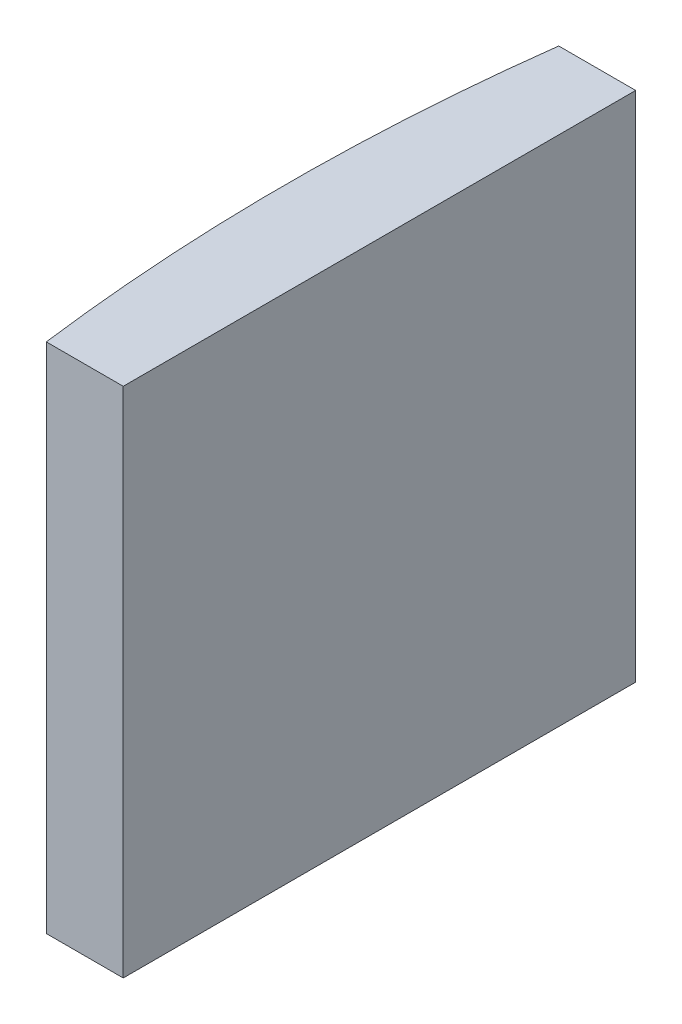
ISO-10303-21;
HEADER;
FILE_DESCRIPTION(('STEP AP214'),'2;1');
FILE_NAME('part.step','',(''),(''),'','','');
FILE_SCHEMA(('AUTOMOTIVE_DESIGN { 1 0 10303 214 1 1 1 1 }'));
ENDSEC;
DATA;
#1=APPLICATION_CONTEXT('core data for automotive mechanical design processes');
#2=APPLICATION_PROTOCOL_DEFINITION('international standard','automotive_design',2000,#1);
#3=PRODUCT_CONTEXT('',#1,'mechanical');
#4=PRODUCT('Part','Part','',(#3));
#5=PRODUCT_RELATED_PRODUCT_CATEGORY('part','',(#4));
#6=PRODUCT_DEFINITION_FORMATION('','',#4);
#7=PRODUCT_DEFINITION_CONTEXT('part definition',#1,'design');
#8=PRODUCT_DEFINITION('design','',#6,#7);
#9=PRODUCT_DEFINITION_SHAPE('','',#8);
#10=(LENGTH_UNIT() NAMED_UNIT(*) SI_UNIT(.MILLI.,.METRE.));
#11=(NAMED_UNIT(*) PLANE_ANGLE_UNIT() SI_UNIT($,.RADIAN.));
#12=(NAMED_UNIT(*) SI_UNIT($,.STERADIAN.) SOLID_ANGLE_UNIT());
#13=UNCERTAINTY_MEASURE_WITH_UNIT(LENGTH_MEASURE(1.E-05),#10,'distance_accuracy_value','');
#14=(GEOMETRIC_REPRESENTATION_CONTEXT(3) GLOBAL_UNCERTAINTY_ASSIGNED_CONTEXT((#13)) GLOBAL_UNIT_ASSIGNED_CONTEXT((#10,
#11,#12)) REPRESENTATION_CONTEXT('',''));
#15=CARTESIAN_POINT('',(0.,0.,0.));
#16=DIRECTION('',(0.,0.,1.));
#17=DIRECTION('',(1.,0.,0.));
#18=AXIS2_PLACEMENT_3D('',#15,#16,#17);
#19=CARTESIAN_POINT('',(4.35520433485127,20.,0.));
#20=DIRECTION('',(0.,-1.,0.));
#21=DIRECTION('',(0.,0.,-1.));
#22=AXIS2_PLACEMENT_3D('',#19,#20,#21);
#23=CYLINDRICAL_SURFACE('',#22,77.55);
#24=CARTESIAN_POINT('',(4.35520433485127,0.,0.));
#25=DIRECTION('',(0.,1.,0.));
#26=DIRECTION('',(0.,0.,1.));
#27=AXIS2_PLACEMENT_3D('',#24,#25,#26);
#28=CIRCLE('',#27,77.55);
#29=CARTESIAN_POINT('',(-72.547347638409,0.,-10.));
#30=VERTEX_POINT('',#29);
#31=CARTESIAN_POINT('',(-72.547347638409,0.,10.));
#32=VERTEX_POINT('',#31);
#33=EDGE_CURVE('E111',#30,#32,#28,.T.);
#34=ORIENTED_EDGE('',*,*,#33,.T.);
#35=DIRECTION('',(0.,-1.,0.));
#36=VECTOR('',#35,1.);
#37=CARTESIAN_POINT('',(-72.547347638409,20.,10.));
#38=LINE('',#37,#36);
#39=CARTESIAN_POINT('',(-72.547347638409,20.,10.));
#40=VERTEX_POINT('',#39);
#41=EDGE_CURVE('E11',#40,#32,#38,.T.);
#42=ORIENTED_EDGE('',*,*,#41,.F.);
#43=CARTESIAN_POINT('',(4.35520433485127,20.,0.));
#44=DIRECTION('',(0.,1.,0.));
#45=DIRECTION('',(0.,0.,1.));
#46=AXIS2_PLACEMENT_3D('',#43,#44,#45);
#47=CIRCLE('',#46,77.55);
#48=CARTESIAN_POINT('',(-72.547347638409,20.,-10.));
#49=VERTEX_POINT('',#48);
#50=EDGE_CURVE('E93',#49,#40,#47,.T.);
#51=ORIENTED_EDGE('',*,*,#50,.F.);
#52=DIRECTION('',(0.,-1.,0.));
#53=VECTOR('',#52,1.);
#54=CARTESIAN_POINT('',(-72.547347638409,20.,-10.));
#55=LINE('',#54,#53);
#56=EDGE_CURVE('E107',#49,#30,#55,.T.);
#57=ORIENTED_EDGE('',*,*,#56,.T.);
#58=EDGE_LOOP('',(#34,#42,#51,#57));
#59=FACE_BOUND('',#58,.T.);
#60=ADVANCED_FACE('F41',(#59),#23,.T.);
#61=CARTESIAN_POINT('',(-72.547347638409,20.,10.));
#62=DIRECTION('',(0.,0.,-1.));
#63=DIRECTION('',(-1.,0.,0.));
#64=AXIS2_PLACEMENT_3D('',#61,#62,#63);
#65=PLANE('',#64);
#66=DIRECTION('',(1.,0.,0.));
#67=VECTOR('',#66,1.);
#68=CARTESIAN_POINT('',(-72.547347638409,0.,10.));
#69=LINE('',#68,#67);
#70=CARTESIAN_POINT('',(-69.5447956651487,0.,10.));
#71=VERTEX_POINT('',#70);
#72=EDGE_CURVE('E98',#32,#71,#69,.T.);
#73=ORIENTED_EDGE('',*,*,#72,.T.);
#74=DIRECTION('',(0.,-1.,0.));
#75=VECTOR('',#74,1.);
#76=CARTESIAN_POINT('',(-69.5447956651487,20.,10.));
#77=LINE('',#76,#75);
#78=CARTESIAN_POINT('',(-69.5447956651487,20.,10.));
#79=VERTEX_POINT('',#78);
#80=EDGE_CURVE('E50',#79,#71,#77,.T.);
#81=ORIENTED_EDGE('',*,*,#80,.F.);
#82=DIRECTION('',(1.,0.,0.));
#83=VECTOR('',#82,1.);
#84=CARTESIAN_POINT('',(-72.547347638409,20.,10.));
#85=LINE('',#84,#83);
#86=EDGE_CURVE('E88',#40,#79,#85,.T.);
#87=ORIENTED_EDGE('',*,*,#86,.F.);
#88=ORIENTED_EDGE('',*,*,#41,.T.);
#89=EDGE_LOOP('',(#73,#81,#87,#88));
#90=FACE_BOUND('',#89,.T.);
#91=ADVANCED_FACE('F97',(#90),#65,.F.);
#92=CARTESIAN_POINT('',(-69.5447956651487,20.,-10.));
#93=DIRECTION('',(-1.,0.,0.));
#94=DIRECTION('',(0.,0.,1.));
#95=AXIS2_PLACEMENT_3D('',#92,#93,#94);
#96=PLANE('',#95);
#97=DIRECTION('',(0.,0.,-1.));
#98=VECTOR('',#97,1.);
#99=CARTESIAN_POINT('',(-69.5447956651487,0.,-10.));
#100=LINE('',#99,#98);
#101=CARTESIAN_POINT('',(-69.5447956651487,0.,-10.));
#102=VERTEX_POINT('',#101);
#103=EDGE_CURVE('E75',#71,#102,#100,.T.);
#104=ORIENTED_EDGE('',*,*,#103,.T.);
#105=DIRECTION('',(0.,-1.,0.));
#106=VECTOR('',#105,1.);
#107=CARTESIAN_POINT('',(-69.5447956651487,20.,-10.));
#108=LINE('',#107,#106);
#109=CARTESIAN_POINT('',(-69.5447956651487,20.,-10.));
#110=VERTEX_POINT('',#109);
#111=EDGE_CURVE('E100',#110,#102,#108,.T.);
#112=ORIENTED_EDGE('',*,*,#111,.F.);
#113=DIRECTION('',(0.,0.,-1.));
#114=VECTOR('',#113,1.);
#115=CARTESIAN_POINT('',(-69.5447956651487,20.,-10.));
#116=LINE('',#115,#114);
#117=EDGE_CURVE('E91',#79,#110,#116,.T.);
#118=ORIENTED_EDGE('',*,*,#117,.F.);
#119=ORIENTED_EDGE('',*,*,#80,.T.);
#120=EDGE_LOOP('',(#104,#112,#118,#119));
#121=FACE_BOUND('',#120,.T.);
#122=ADVANCED_FACE('F101',(#121),#96,.F.);
#123=CARTESIAN_POINT('',(-72.547347638409,20.,-10.));
#124=DIRECTION('',(0.,0.,1.));
#125=DIRECTION('',(1.,0.,0.));
#126=AXIS2_PLACEMENT_3D('',#123,#124,#125);
#127=PLANE('',#126);
#128=DIRECTION('',(-1.,0.,0.));
#129=VECTOR('',#128,1.);
#130=CARTESIAN_POINT('',(-72.547347638409,0.,-10.));
#131=LINE('',#130,#129);
#132=EDGE_CURVE('E81',#102,#30,#131,.T.);
#133=ORIENTED_EDGE('',*,*,#132,.T.);
#134=ORIENTED_EDGE('',*,*,#56,.F.);
#135=DIRECTION('',(-1.,0.,0.));
#136=VECTOR('',#135,1.);
#137=CARTESIAN_POINT('',(-72.547347638409,20.,-10.));
#138=LINE('',#137,#136);
#139=EDGE_CURVE('E58',#110,#49,#138,.T.);
#140=ORIENTED_EDGE('',*,*,#139,.F.);
#141=ORIENTED_EDGE('',*,*,#111,.T.);
#142=EDGE_LOOP('',(#133,#134,#140,#141));
#143=FACE_BOUND('',#142,.T.);
#144=ADVANCED_FACE('F123',(#143),#127,.F.);
#145=CARTESIAN_POINT('',(4.35520433485127,20.,0.));
#146=DIRECTION('',(0.,1.,0.));
#147=DIRECTION('',(0.,0.,1.));
#148=AXIS2_PLACEMENT_3D('',#145,#146,#147);
#149=PLANE('',#148);
#150=ORIENTED_EDGE('',*,*,#50,.T.);
#151=ORIENTED_EDGE('',*,*,#86,.T.);
#152=ORIENTED_EDGE('',*,*,#117,.T.);
#153=ORIENTED_EDGE('',*,*,#139,.T.);
#154=EDGE_LOOP('',(#150,#151,#152,#153));
#155=FACE_BOUND('',#154,.T.);
#156=ADVANCED_FACE('F89',(#155),#149,.T.);
#157=CARTESIAN_POINT('',(4.35520433485127,0.,0.));
#158=DIRECTION('',(0.,1.,0.));
#159=DIRECTION('',(0.,0.,1.));
#160=AXIS2_PLACEMENT_3D('',#157,#158,#159);
#161=PLANE('',#160);
#162=ORIENTED_EDGE('',*,*,#33,.F.);
#163=ORIENTED_EDGE('',*,*,#132,.F.);
#164=ORIENTED_EDGE('',*,*,#103,.F.);
#165=ORIENTED_EDGE('',*,*,#72,.F.);
#166=EDGE_LOOP('',(#162,#163,#164,#165));
#167=FACE_BOUND('',#166,.T.);
#168=ADVANCED_FACE('F126',(#167),#161,.F.);
#169=CLOSED_SHELL('',(#60,#91,#122,#144,#156,#168));
#170=MANIFOLD_SOLID_BREP('B2',#169);
#171=ADVANCED_BREP_SHAPE_REPRESENTATION('',(#18,#170),#14);
#172=SHAPE_DEFINITION_REPRESENTATION(#9,#171);
ENDSEC;
END-ISO-10303-21;
